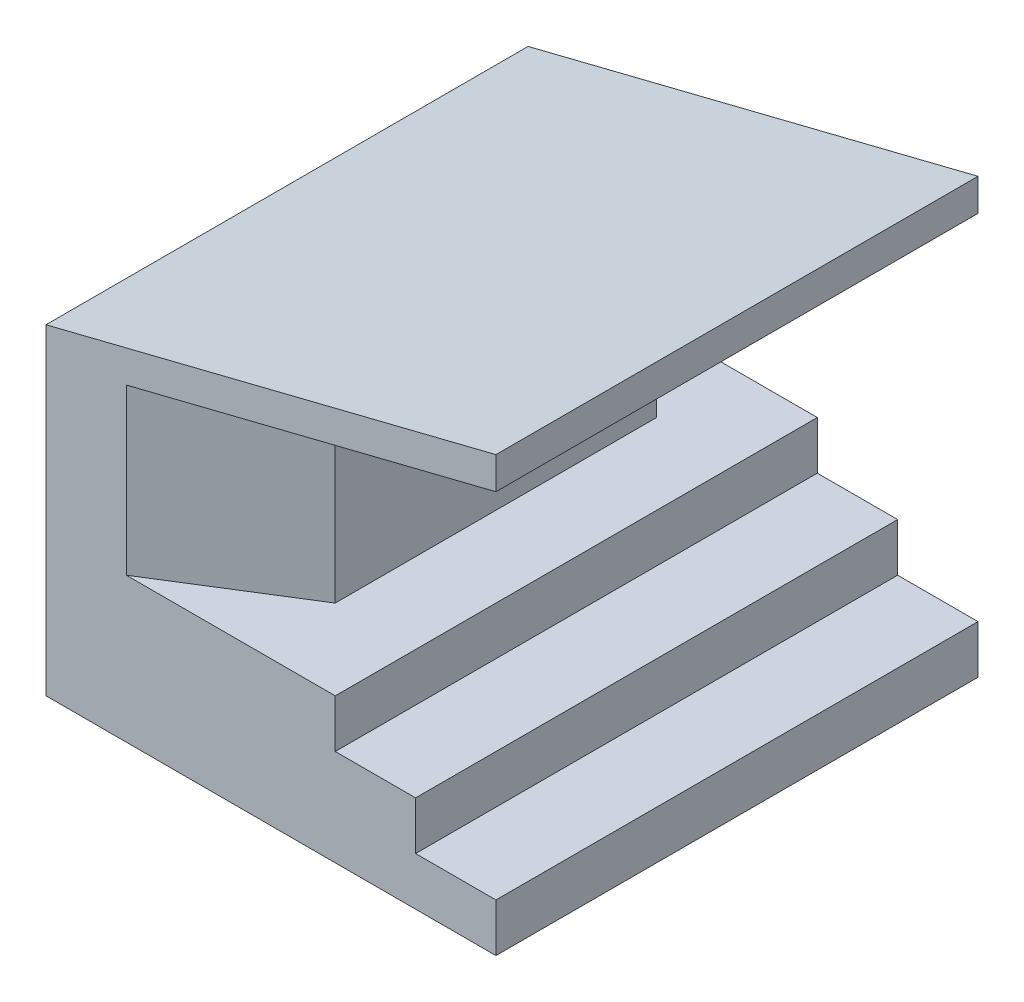
ISO-10303-21;
HEADER;
FILE_DESCRIPTION(('STEP AP214'),'2;1');
FILE_NAME('part.step','',(''),(''),'','','');
FILE_SCHEMA(('AUTOMOTIVE_DESIGN { 1 0 10303 214 1 1 1 1 }'));
ENDSEC;
DATA;
#1=APPLICATION_CONTEXT('core data for automotive mechanical design processes');
#2=APPLICATION_PROTOCOL_DEFINITION('international standard','automotive_design',2000,#1);
#3=PRODUCT_CONTEXT('',#1,'mechanical');
#4=PRODUCT('Part','Part','',(#3));
#5=PRODUCT_RELATED_PRODUCT_CATEGORY('part','',(#4));
#6=PRODUCT_DEFINITION_FORMATION('','',#4);
#7=PRODUCT_DEFINITION_CONTEXT('part definition',#1,'design');
#8=PRODUCT_DEFINITION('design','',#6,#7);
#9=PRODUCT_DEFINITION_SHAPE('','',#8);
#10=(LENGTH_UNIT() NAMED_UNIT(*) SI_UNIT(.MILLI.,.METRE.));
#11=(NAMED_UNIT(*) PLANE_ANGLE_UNIT() SI_UNIT($,.RADIAN.));
#12=(NAMED_UNIT(*) SI_UNIT($,.STERADIAN.) SOLID_ANGLE_UNIT());
#13=UNCERTAINTY_MEASURE_WITH_UNIT(LENGTH_MEASURE(1.E-05),#10,'distance_accuracy_value','');
#14=(GEOMETRIC_REPRESENTATION_CONTEXT(3) GLOBAL_UNCERTAINTY_ASSIGNED_CONTEXT((#13)) GLOBAL_UNIT_ASSIGNED_CONTEXT((#10,
#11,#12)) REPRESENTATION_CONTEXT('',''));
#15=CARTESIAN_POINT('',(0.,0.,0.));
#16=DIRECTION('',(0.,0.,1.));
#17=DIRECTION('',(1.,0.,0.));
#18=AXIS2_PLACEMENT_3D('',#15,#16,#17);
#19=CARTESIAN_POINT('',(-115.,96.25,-150.));
#20=DIRECTION('',(0.242535625036333,-0.970142500145332,0.));
#21=DIRECTION('',(0.970142500145332,0.242535625036333,0.));
#22=AXIS2_PLACEMENT_3D('',#19,#20,#21);
#23=PLANE('',#22);
#24=DIRECTION('',(0.,0.,1.));
#25=VECTOR('',#24,1.);
#26=CARTESIAN_POINT('',(-75.,106.25,-125.));
#27=LINE('',#26,#25);
#28=CARTESIAN_POINT('',(-75.,106.25,-125.));
#29=VERTEX_POINT('',#28);
#30=CARTESIAN_POINT('',(-75.,106.25,-25.));
#31=VERTEX_POINT('',#30);
#32=EDGE_CURVE('E172',#29,#31,#27,.T.);
#33=ORIENTED_EDGE('',*,*,#32,.F.);
#34=DIRECTION('',(0.82956135578434,0.207390338946085,0.518475847365213));
#35=VECTOR('',#34,1.);
#36=CARTESIAN_POINT('',(-87.0205353100514,103.244866172487,-132.512834568782));
#37=LINE('',#36,#35);
#38=CARTESIAN_POINT('',(-115.,96.25,-150.));
#39=VERTEX_POINT('',#38);
#40=EDGE_CURVE('E181',#39,#29,#37,.T.);
#41=ORIENTED_EDGE('',*,*,#40,.F.);
#42=DIRECTION('',(0.970142500145332,0.242535625036333,0.));
#43=VECTOR('',#42,1.);
#44=CARTESIAN_POINT('',(-115.,96.25,-150.));
#45=LINE('',#44,#43);
#46=CARTESIAN_POINT('',(0.,125.,-150.));
#47=VERTEX_POINT('',#46);
#48=EDGE_CURVE('E209',#39,#47,#45,.T.);
#49=ORIENTED_EDGE('',*,*,#48,.T.);
#50=DIRECTION('',(0.,0.,1.));
#51=VECTOR('',#50,1.);
#52=CARTESIAN_POINT('',(0.,125.,-150.));
#53=LINE('',#52,#51);
#54=CARTESIAN_POINT('',(0.,125.,0.));
#55=VERTEX_POINT('',#54);
#56=EDGE_CURVE('E146',#47,#55,#53,.T.);
#57=ORIENTED_EDGE('',*,*,#56,.T.);
#58=DIRECTION('',(0.970142500145332,0.242535625036333,0.));
#59=VECTOR('',#58,1.);
#60=CARTESIAN_POINT('',(-115.,96.25,0.));
#61=LINE('',#60,#59);
#62=CARTESIAN_POINT('',(-115.,96.25,0.));
#63=VERTEX_POINT('',#62);
#64=EDGE_CURVE('E140',#63,#55,#61,.T.);
#65=ORIENTED_EDGE('',*,*,#64,.F.);
#66=DIRECTION('',(-0.82956135578434,-0.207390338946085,0.518475847365212));
#67=VECTOR('',#66,1.);
#68=CARTESIAN_POINT('',(-48.7409654175782,112.814758645605,-41.4118966140136));
#69=LINE('',#68,#67);
#70=EDGE_CURVE('E170',#31,#63,#69,.T.);
#71=ORIENTED_EDGE('',*,*,#70,.F.);
#72=EDGE_LOOP('',(#33,#41,#49,#57,#65,#71));
#73=FACE_BOUND('',#72,.T.);
#74=ADVANCED_FACE('F30',(#73),#23,.T.);
#75=CARTESIAN_POINT('',(-50.,45.,-150.));
#76=DIRECTION('',(0.,1.,0.));
#77=DIRECTION('',(0.,0.,1.));
#78=AXIS2_PLACEMENT_3D('',#75,#76,#77);
#79=PLANE('',#78);
#80=DIRECTION('',(-1.,0.,0.));
#81=VECTOR('',#80,1.);
#82=CARTESIAN_POINT('',(-50.,45.,-150.));
#83=LINE('',#82,#81);
#84=CARTESIAN_POINT('',(-50.,45.,-150.));
#85=VERTEX_POINT('',#84);
#86=CARTESIAN_POINT('',(-115.,45.,-150.));
#87=VERTEX_POINT('',#86);
#88=EDGE_CURVE('E203',#85,#87,#83,.T.);
#89=ORIENTED_EDGE('',*,*,#88,.T.);
#90=DIRECTION('',(-0.847998304005088,0.,-0.52999894000318));
#91=VECTOR('',#90,1.);
#92=CARTESIAN_POINT('',(-115.,45.,-150.));
#93=LINE('',#92,#91);
#94=CARTESIAN_POINT('',(-75.,45.,-125.));
#95=VERTEX_POINT('',#94);
#96=EDGE_CURVE('E190',#95,#87,#93,.T.);
#97=ORIENTED_EDGE('',*,*,#96,.F.);
#98=DIRECTION('',(0.,0.,-1.));
#99=VECTOR('',#98,1.);
#100=CARTESIAN_POINT('',(-75.,45.,-125.));
#101=LINE('',#100,#99);
#102=CARTESIAN_POINT('',(-75.,45.,-25.));
#103=VERTEX_POINT('',#102);
#104=EDGE_CURVE('E187',#103,#95,#101,.T.);
#105=ORIENTED_EDGE('',*,*,#104,.F.);
#106=DIRECTION('',(0.847998304005088,0.,-0.52999894000318));
#107=VECTOR('',#106,1.);
#108=CARTESIAN_POINT('',(-75.,45.,-25.));
#109=LINE('',#108,#107);
#110=CARTESIAN_POINT('',(-115.,45.,0.));
#111=VERTEX_POINT('',#110);
#112=EDGE_CURVE('E184',#111,#103,#109,.T.);
#113=ORIENTED_EDGE('',*,*,#112,.F.);
#114=DIRECTION('',(-1.,0.,0.));
#115=VECTOR('',#114,1.);
#116=CARTESIAN_POINT('',(-50.,45.,0.));
#117=LINE('',#116,#115);
#118=CARTESIAN_POINT('',(-50.,45.,0.));
#119=VERTEX_POINT('',#118);
#120=EDGE_CURVE('E218',#119,#111,#117,.T.);
#121=ORIENTED_EDGE('',*,*,#120,.F.);
#122=DIRECTION('',(0.,0.,1.));
#123=VECTOR('',#122,1.);
#124=CARTESIAN_POINT('',(-50.,45.,-150.));
#125=LINE('',#124,#123);
#126=EDGE_CURVE('E149',#85,#119,#125,.T.);
#127=ORIENTED_EDGE('',*,*,#126,.F.);
#128=EDGE_LOOP('',(#89,#97,#105,#113,#121,#127));
#129=FACE_BOUND('',#128,.T.);
#130=ADVANCED_FACE('F283',(#129),#79,.T.);
#131=CARTESIAN_POINT('',(0.,15.,-150.));
#132=DIRECTION('',(0.,1.,0.));
#133=DIRECTION('',(0.,0.,1.));
#134=AXIS2_PLACEMENT_3D('',#131,#132,#133);
#135=PLANE('',#134);
#136=DIRECTION('',(-1.,0.,0.));
#137=VECTOR('',#136,1.);
#138=CARTESIAN_POINT('',(0.,15.,-150.));
#139=LINE('',#138,#137);
#140=CARTESIAN_POINT('',(0.,15.,-150.));
#141=VERTEX_POINT('',#140);
#142=CARTESIAN_POINT('',(-25.,15.,-150.));
#143=VERTEX_POINT('',#142);
#144=EDGE_CURVE('E110',#141,#143,#139,.T.);
#145=ORIENTED_EDGE('',*,*,#144,.T.);
#146=DIRECTION('',(0.,0.,1.));
#147=VECTOR('',#146,1.);
#148=CARTESIAN_POINT('',(-25.,15.,-150.));
#149=LINE('',#148,#147);
#150=CARTESIAN_POINT('',(-25.,15.,0.));
#151=VERTEX_POINT('',#150);
#152=EDGE_CURVE('E122',#143,#151,#149,.T.);
#153=ORIENTED_EDGE('',*,*,#152,.T.);
#154=DIRECTION('',(1.,0.,0.));
#155=VECTOR('',#154,1.);
#156=CARTESIAN_POINT('',(0.,15.,0.));
#157=LINE('',#156,#155);
#158=CARTESIAN_POINT('',(0.,15.,0.));
#159=VERTEX_POINT('',#158);
#160=EDGE_CURVE('E55',#151,#159,#157,.T.);
#161=ORIENTED_EDGE('',*,*,#160,.T.);
#162=DIRECTION('',(0.,0.,-1.));
#163=VECTOR('',#162,1.);
#164=CARTESIAN_POINT('',(0.,15.,0.));
#165=LINE('',#164,#163);
#166=EDGE_CURVE('E86',#159,#141,#165,.T.);
#167=ORIENTED_EDGE('',*,*,#166,.T.);
#168=EDGE_LOOP('',(#145,#153,#161,#167));
#169=FACE_BOUND('',#168,.T.);
#170=ADVANCED_FACE('F287',(#169),#135,.T.);
#171=CARTESIAN_POINT('',(0.,15.,0.));
#172=DIRECTION('',(-1.,0.,0.));
#173=DIRECTION('',(0.,0.,1.));
#174=AXIS2_PLACEMENT_3D('',#171,#172,#173);
#175=PLANE('',#174);
#176=DIRECTION('',(0.,0.,-1.));
#177=VECTOR('',#176,1.);
#178=CARTESIAN_POINT('',(0.,0.,0.));
#179=LINE('',#178,#177);
#180=CARTESIAN_POINT('',(0.,0.,0.));
#181=VERTEX_POINT('',#180);
#182=CARTESIAN_POINT('',(0.,0.,-150.));
#183=VERTEX_POINT('',#182);
#184=EDGE_CURVE('E92',#181,#183,#179,.T.);
#185=ORIENTED_EDGE('',*,*,#184,.T.);
#186=DIRECTION('',(0.,-1.,0.));
#187=VECTOR('',#186,1.);
#188=CARTESIAN_POINT('',(0.,15.,-150.));
#189=LINE('',#188,#187);
#190=EDGE_CURVE('E11',#141,#183,#189,.T.);
#191=ORIENTED_EDGE('',*,*,#190,.F.);
#192=ORIENTED_EDGE('',*,*,#166,.F.);
#193=DIRECTION('',(0.,-1.,0.));
#194=VECTOR('',#193,1.);
#195=CARTESIAN_POINT('',(0.,15.,0.));
#196=LINE('',#195,#194);
#197=EDGE_CURVE('E78',#159,#181,#196,.T.);
#198=ORIENTED_EDGE('',*,*,#197,.T.);
#199=EDGE_LOOP('',(#185,#191,#192,#198));
#200=FACE_BOUND('',#199,.T.);
#201=ADVANCED_FACE('F32',(#200),#175,.F.);
#202=CARTESIAN_POINT('',(0.,15.,-150.));
#203=DIRECTION('',(0.,0.,1.));
#204=DIRECTION('',(1.,0.,0.));
#205=AXIS2_PLACEMENT_3D('',#202,#203,#204);
#206=PLANE('',#205);
#207=DIRECTION('',(-1.,0.,0.));
#208=VECTOR('',#207,1.);
#209=CARTESIAN_POINT('',(0.,0.,-150.));
#210=LINE('',#209,#208);
#211=CARTESIAN_POINT('',(-140.,0.,-150.));
#212=VERTEX_POINT('',#211);
#213=EDGE_CURVE('E95',#183,#212,#210,.T.);
#214=ORIENTED_EDGE('',*,*,#213,.T.);
#215=DIRECTION('',(0.,-1.,0.));
#216=VECTOR('',#215,1.);
#217=CARTESIAN_POINT('',(-140.,15.,-150.));
#218=LINE('',#217,#216);
#219=CARTESIAN_POINT('',(-140.,100.,-150.));
#220=VERTEX_POINT('',#219);
#221=EDGE_CURVE('E39',#220,#212,#218,.T.);
#222=ORIENTED_EDGE('',*,*,#221,.F.);
#223=DIRECTION('',(-0.970142500145332,-0.242535625036333,0.));
#224=VECTOR('',#223,1.);
#225=CARTESIAN_POINT('',(0.,135.,-150.));
#226=LINE('',#225,#224);
#227=CARTESIAN_POINT('',(0.,135.,-150.));
#228=VERTEX_POINT('',#227);
#229=EDGE_CURVE('E124',#228,#220,#226,.T.);
#230=ORIENTED_EDGE('',*,*,#229,.F.);
#231=DIRECTION('',(0.,1.,0.));
#232=VECTOR('',#231,1.);
#233=CARTESIAN_POINT('',(0.,125.,-150.));
#234=LINE('',#233,#232);
#235=EDGE_CURVE('E212',#47,#228,#234,.T.);
#236=ORIENTED_EDGE('',*,*,#235,.F.);
#237=ORIENTED_EDGE('',*,*,#48,.F.);
#238=DIRECTION('',(0.,1.,0.));
#239=VECTOR('',#238,1.);
#240=CARTESIAN_POINT('',(-115.,45.,-150.));
#241=LINE('',#240,#239);
#242=EDGE_CURVE('E206',#87,#39,#241,.T.);
#243=ORIENTED_EDGE('',*,*,#242,.F.);
#244=ORIENTED_EDGE('',*,*,#88,.F.);
#245=DIRECTION('',(0.,1.,0.));
#246=VECTOR('',#245,1.);
#247=CARTESIAN_POINT('',(-50.,30.,-150.));
#248=LINE('',#247,#246);
#249=CARTESIAN_POINT('',(-50.,30.,-150.));
#250=VERTEX_POINT('',#249);
#251=EDGE_CURVE('E133',#250,#85,#248,.T.);
#252=ORIENTED_EDGE('',*,*,#251,.F.);
#253=DIRECTION('',(-1.,0.,0.));
#254=VECTOR('',#253,1.);
#255=CARTESIAN_POINT('',(-25.,30.,-150.));
#256=LINE('',#255,#254);
#257=CARTESIAN_POINT('',(-25.,30.,-150.));
#258=VERTEX_POINT('',#257);
#259=EDGE_CURVE('E128',#258,#250,#256,.T.);
#260=ORIENTED_EDGE('',*,*,#259,.F.);
#261=DIRECTION('',(0.,1.,0.));
#262=VECTOR('',#261,1.);
#263=CARTESIAN_POINT('',(-25.,15.,-150.));
#264=LINE('',#263,#262);
#265=EDGE_CURVE('E126',#143,#258,#264,.T.);
#266=ORIENTED_EDGE('',*,*,#265,.F.);
#267=ORIENTED_EDGE('',*,*,#144,.F.);
#268=ORIENTED_EDGE('',*,*,#190,.T.);
#269=EDGE_LOOP('',(#214,#222,#230,#236,#237,#243,#244,#252,#260,#266,#267,#268));
#270=FACE_BOUND('',#269,.T.);
#271=ADVANCED_FACE('F267',(#270),#206,.F.);
#272=CARTESIAN_POINT('',(-140.,15.,0.));
#273=DIRECTION('',(1.,0.,0.));
#274=DIRECTION('',(0.,0.,-1.));
#275=AXIS2_PLACEMENT_3D('',#272,#273,#274);
#276=PLANE('',#275);
#277=DIRECTION('',(0.,0.,1.));
#278=VECTOR('',#277,1.);
#279=CARTESIAN_POINT('',(-140.,0.,0.));
#280=LINE('',#279,#278);
#281=CARTESIAN_POINT('',(-140.,0.,0.));
#282=VERTEX_POINT('',#281);
#283=EDGE_CURVE('E87',#212,#282,#280,.T.);
#284=ORIENTED_EDGE('',*,*,#283,.T.);
#285=DIRECTION('',(0.,-1.,0.));
#286=VECTOR('',#285,1.);
#287=CARTESIAN_POINT('',(-140.,15.,0.));
#288=LINE('',#287,#286);
#289=CARTESIAN_POINT('',(-140.,100.,0.));
#290=VERTEX_POINT('',#289);
#291=EDGE_CURVE('E82',#290,#282,#288,.T.);
#292=ORIENTED_EDGE('',*,*,#291,.F.);
#293=DIRECTION('',(0.,0.,1.));
#294=VECTOR('',#293,1.);
#295=CARTESIAN_POINT('',(-140.,100.,-150.));
#296=LINE('',#295,#294);
#297=EDGE_CURVE('E96',#220,#290,#296,.T.);
#298=ORIENTED_EDGE('',*,*,#297,.F.);
#299=ORIENTED_EDGE('',*,*,#221,.T.);
#300=EDGE_LOOP('',(#284,#292,#298,#299));
#301=FACE_BOUND('',#300,.T.);
#302=ADVANCED_FACE('F261',(#301),#276,.F.);
#303=CARTESIAN_POINT('',(0.,15.,0.));
#304=DIRECTION('',(0.,0.,-1.));
#305=DIRECTION('',(-1.,0.,0.));
#306=AXIS2_PLACEMENT_3D('',#303,#304,#305);
#307=PLANE('',#306);
#308=DIRECTION('',(1.,0.,0.));
#309=VECTOR('',#308,1.);
#310=CARTESIAN_POINT('',(0.,0.,0.));
#311=LINE('',#310,#309);
#312=EDGE_CURVE('E75',#282,#181,#311,.T.);
#313=ORIENTED_EDGE('',*,*,#312,.T.);
#314=ORIENTED_EDGE('',*,*,#197,.F.);
#315=ORIENTED_EDGE('',*,*,#160,.F.);
#316=DIRECTION('',(0.,1.,0.));
#317=VECTOR('',#316,1.);
#318=CARTESIAN_POINT('',(-25.,15.,0.));
#319=LINE('',#318,#317);
#320=CARTESIAN_POINT('',(-25.,30.,0.));
#321=VERTEX_POINT('',#320);
#322=EDGE_CURVE('E47',#151,#321,#319,.T.);
#323=ORIENTED_EDGE('',*,*,#322,.T.);
#324=DIRECTION('',(-1.,0.,0.));
#325=VECTOR('',#324,1.);
#326=CARTESIAN_POINT('',(-25.,30.,0.));
#327=LINE('',#326,#325);
#328=CARTESIAN_POINT('',(-50.,30.,0.));
#329=VERTEX_POINT('',#328);
#330=EDGE_CURVE('E165',#321,#329,#327,.T.);
#331=ORIENTED_EDGE('',*,*,#330,.T.);
#332=DIRECTION('',(0.,1.,0.));
#333=VECTOR('',#332,1.);
#334=CARTESIAN_POINT('',(-50.,30.,0.));
#335=LINE('',#334,#333);
#336=EDGE_CURVE('E168',#329,#119,#335,.T.);
#337=ORIENTED_EDGE('',*,*,#336,.T.);
#338=ORIENTED_EDGE('',*,*,#120,.T.);
#339=DIRECTION('',(0.,1.,0.));
#340=VECTOR('',#339,1.);
#341=CARTESIAN_POINT('',(-115.,45.,0.));
#342=LINE('',#341,#340);
#343=EDGE_CURVE('E221',#111,#63,#342,.T.);
#344=ORIENTED_EDGE('',*,*,#343,.T.);
#345=ORIENTED_EDGE('',*,*,#64,.T.);
#346=DIRECTION('',(0.,1.,0.));
#347=VECTOR('',#346,1.);
#348=CARTESIAN_POINT('',(0.,125.,0.));
#349=LINE('',#348,#347);
#350=CARTESIAN_POINT('',(0.,135.,0.));
#351=VERTEX_POINT('',#350);
#352=EDGE_CURVE('E135',#55,#351,#349,.T.);
#353=ORIENTED_EDGE('',*,*,#352,.T.);
#354=DIRECTION('',(-0.970142500145332,-0.242535625036333,0.));
#355=VECTOR('',#354,1.);
#356=CARTESIAN_POINT('',(0.,135.,0.));
#357=LINE('',#356,#355);
#358=EDGE_CURVE('E129',#351,#290,#357,.T.);
#359=ORIENTED_EDGE('',*,*,#358,.T.);
#360=ORIENTED_EDGE('',*,*,#291,.T.);
#361=EDGE_LOOP('',(#313,#314,#315,#323,#331,#337,#338,#344,#345,#353,#359,#360));
#362=FACE_BOUND('',#361,.T.);
#363=ADVANCED_FACE('F77',(#362),#307,.F.);
#364=CARTESIAN_POINT('',(0.,0.,-150.));
#365=DIRECTION('',(0.,1.,0.));
#366=DIRECTION('',(0.,0.,1.));
#367=AXIS2_PLACEMENT_3D('',#364,#365,#366);
#368=PLANE('',#367);
#369=ORIENTED_EDGE('',*,*,#184,.F.);
#370=ORIENTED_EDGE('',*,*,#312,.F.);
#371=ORIENTED_EDGE('',*,*,#283,.F.);
#372=ORIENTED_EDGE('',*,*,#213,.F.);
#373=EDGE_LOOP('',(#369,#370,#371,#372));
#374=FACE_BOUND('',#373,.T.);
#375=ADVANCED_FACE('F94',(#374),#368,.F.);
#376=CARTESIAN_POINT('',(0.,135.,-150.));
#377=DIRECTION('',(-0.242535625036333,0.970142500145332,0.));
#378=DIRECTION('',(-0.970142500145332,-0.242535625036333,0.));
#379=AXIS2_PLACEMENT_3D('',#376,#377,#378);
#380=PLANE('',#379);
#381=ORIENTED_EDGE('',*,*,#358,.F.);
#382=DIRECTION('',(0.,0.,1.));
#383=VECTOR('',#382,1.);
#384=CARTESIAN_POINT('',(0.,135.,-150.));
#385=LINE('',#384,#383);
#386=EDGE_CURVE('E100',#228,#351,#385,.T.);
#387=ORIENTED_EDGE('',*,*,#386,.F.);
#388=ORIENTED_EDGE('',*,*,#229,.T.);
#389=ORIENTED_EDGE('',*,*,#297,.T.);
#390=EDGE_LOOP('',(#381,#387,#388,#389));
#391=FACE_BOUND('',#390,.T.);
#392=ADVANCED_FACE('F263',(#391),#380,.T.);
#393=CARTESIAN_POINT('',(0.,125.,-150.));
#394=DIRECTION('',(1.,0.,0.));
#395=DIRECTION('',(0.,0.,-1.));
#396=AXIS2_PLACEMENT_3D('',#393,#394,#395);
#397=PLANE('',#396);
#398=ORIENTED_EDGE('',*,*,#352,.F.);
#399=ORIENTED_EDGE('',*,*,#56,.F.);
#400=ORIENTED_EDGE('',*,*,#235,.T.);
#401=ORIENTED_EDGE('',*,*,#386,.T.);
#402=EDGE_LOOP('',(#398,#399,#400,#401));
#403=FACE_BOUND('',#402,.T.);
#404=ADVANCED_FACE('F270',(#403),#397,.T.);
#405=CARTESIAN_POINT('',(-50.,30.,-150.));
#406=DIRECTION('',(1.,0.,0.));
#407=DIRECTION('',(0.,0.,-1.));
#408=AXIS2_PLACEMENT_3D('',#405,#406,#407);
#409=PLANE('',#408);
#410=ORIENTED_EDGE('',*,*,#336,.F.);
#411=DIRECTION('',(0.,0.,1.));
#412=VECTOR('',#411,1.);
#413=CARTESIAN_POINT('',(-50.,30.,-150.));
#414=LINE('',#413,#412);
#415=EDGE_CURVE('E151',#250,#329,#414,.T.);
#416=ORIENTED_EDGE('',*,*,#415,.F.);
#417=ORIENTED_EDGE('',*,*,#251,.T.);
#418=ORIENTED_EDGE('',*,*,#126,.T.);
#419=EDGE_LOOP('',(#410,#416,#417,#418));
#420=FACE_BOUND('',#419,.T.);
#421=ADVANCED_FACE('F272',(#420),#409,.T.);
#422=CARTESIAN_POINT('',(-25.,30.,-150.));
#423=DIRECTION('',(0.,1.,0.));
#424=DIRECTION('',(-1.,0.,0.));
#425=AXIS2_PLACEMENT_3D('',#422,#423,#424);
#426=PLANE('',#425);
#427=ORIENTED_EDGE('',*,*,#330,.F.);
#428=DIRECTION('',(0.,0.,1.));
#429=VECTOR('',#428,1.);
#430=CARTESIAN_POINT('',(-25.,30.,-150.));
#431=LINE('',#430,#429);
#432=EDGE_CURVE('E119',#258,#321,#431,.T.);
#433=ORIENTED_EDGE('',*,*,#432,.F.);
#434=ORIENTED_EDGE('',*,*,#259,.T.);
#435=ORIENTED_EDGE('',*,*,#415,.T.);
#436=EDGE_LOOP('',(#427,#433,#434,#435));
#437=FACE_BOUND('',#436,.T.);
#438=ADVANCED_FACE('F166',(#437),#426,.T.);
#439=CARTESIAN_POINT('',(-25.,15.,-150.));
#440=DIRECTION('',(1.,0.,0.));
#441=DIRECTION('',(0.,1.,0.));
#442=AXIS2_PLACEMENT_3D('',#439,#440,#441);
#443=PLANE('',#442);
#444=ORIENTED_EDGE('',*,*,#322,.F.);
#445=ORIENTED_EDGE('',*,*,#152,.F.);
#446=ORIENTED_EDGE('',*,*,#265,.T.);
#447=ORIENTED_EDGE('',*,*,#432,.T.);
#448=EDGE_LOOP('',(#444,#445,#446,#447));
#449=FACE_BOUND('',#448,.T.);
#450=ADVANCED_FACE('F160',(#449),#443,.T.);
#451=CARTESIAN_POINT('',(-115.,258.880638510326,-150.));
#452=DIRECTION('',(-0.52999894000318,0.,0.847998304005088));
#453=DIRECTION('',(0.847998304005088,0.,0.52999894000318));
#454=AXIS2_PLACEMENT_3D('',#451,#452,#453);
#455=PLANE('',#454);
#456=ORIENTED_EDGE('',*,*,#242,.T.);
#457=ORIENTED_EDGE('',*,*,#40,.T.);
#458=DIRECTION('',(0.,-1.,0.));
#459=VECTOR('',#458,1.);
#460=CARTESIAN_POINT('',(-75.,258.880638510326,-125.));
#461=LINE('',#460,#459);
#462=EDGE_CURVE('E193',#29,#95,#461,.T.);
#463=ORIENTED_EDGE('',*,*,#462,.T.);
#464=ORIENTED_EDGE('',*,*,#96,.T.);
#465=EDGE_LOOP('',(#456,#457,#463,#464));
#466=FACE_BOUND('',#465,.T.);
#467=ADVANCED_FACE('F295',(#466),#455,.F.);
#468=CARTESIAN_POINT('',(-75.,258.880638510326,-125.));
#469=DIRECTION('',(-1.,0.,0.));
#470=DIRECTION('',(0.,0.,1.));
#471=AXIS2_PLACEMENT_3D('',#468,#469,#470);
#472=PLANE('',#471);
#473=ORIENTED_EDGE('',*,*,#462,.F.);
#474=ORIENTED_EDGE('',*,*,#32,.T.);
#475=DIRECTION('',(0.,-1.,0.));
#476=VECTOR('',#475,1.);
#477=CARTESIAN_POINT('',(-75.,258.880638510326,-25.));
#478=LINE('',#477,#476);
#479=EDGE_CURVE('E196',#31,#103,#478,.T.);
#480=ORIENTED_EDGE('',*,*,#479,.T.);
#481=ORIENTED_EDGE('',*,*,#104,.T.);
#482=EDGE_LOOP('',(#473,#474,#480,#481));
#483=FACE_BOUND('',#482,.T.);
#484=ADVANCED_FACE('F346',(#483),#472,.F.);
#485=CARTESIAN_POINT('',(-75.,258.880638510326,-25.));
#486=DIRECTION('',(-0.52999894000318,0.,-0.847998304005088));
#487=DIRECTION('',(-0.847998304005088,0.,0.52999894000318));
#488=AXIS2_PLACEMENT_3D('',#485,#486,#487);
#489=PLANE('',#488);
#490=ORIENTED_EDGE('',*,*,#479,.F.);
#491=ORIENTED_EDGE('',*,*,#70,.T.);
#492=ORIENTED_EDGE('',*,*,#343,.F.);
#493=ORIENTED_EDGE('',*,*,#112,.T.);
#494=EDGE_LOOP('',(#490,#491,#492,#493));
#495=FACE_BOUND('',#494,.T.);
#496=ADVANCED_FACE('F356',(#495),#489,.F.);
#497=CLOSED_SHELL('',(#74,#130,#170,#201,#271,#302,#363,#375,#392,#404,#421,#438,#450,#467,#484,#496));
#498=MANIFOLD_SOLID_BREP('B2',#497);
#499=ADVANCED_BREP_SHAPE_REPRESENTATION('',(#18,#498),#14);
#500=SHAPE_DEFINITION_REPRESENTATION(#9,#499);
ENDSEC;
END-ISO-10303-21;
